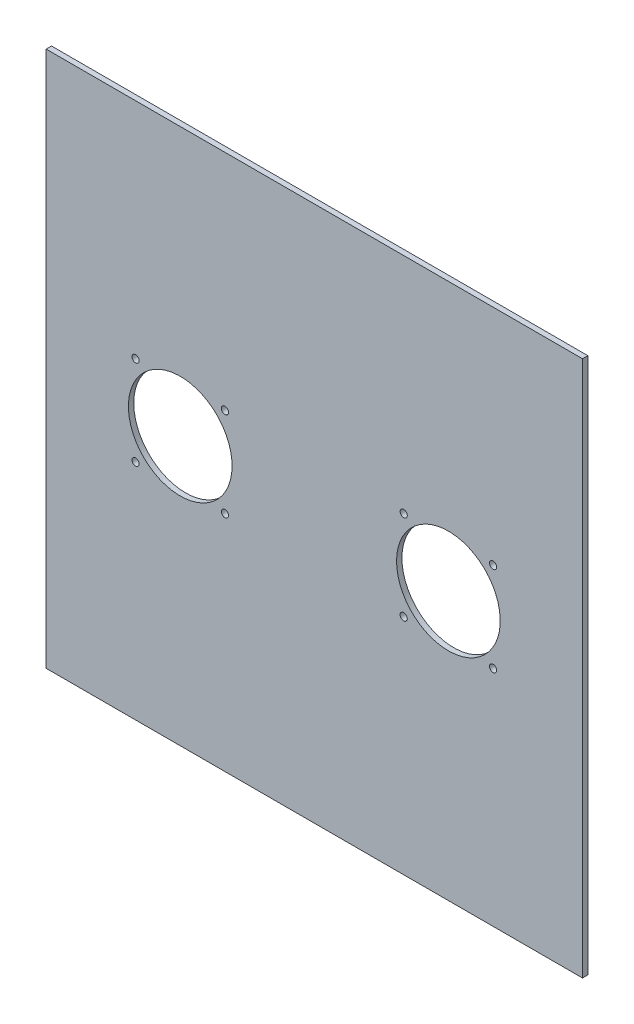
ISO-10303-21;
HEADER;
FILE_DESCRIPTION(('STEP AP214'),'2;1');
FILE_NAME('part.step','',(''),(''),'','','');
FILE_SCHEMA(('AUTOMOTIVE_DESIGN { 1 0 10303 214 1 1 1 1 }'));
ENDSEC;
DATA;
#1=APPLICATION_CONTEXT('core data for automotive mechanical design processes');
#2=APPLICATION_PROTOCOL_DEFINITION('international standard','automotive_design',2000,#1);
#3=PRODUCT_CONTEXT('',#1,'mechanical');
#4=PRODUCT('Part','Part','',(#3));
#5=PRODUCT_RELATED_PRODUCT_CATEGORY('part','',(#4));
#6=PRODUCT_DEFINITION_FORMATION('','',#4);
#7=PRODUCT_DEFINITION_CONTEXT('part definition',#1,'design');
#8=PRODUCT_DEFINITION('design','',#6,#7);
#9=PRODUCT_DEFINITION_SHAPE('','',#8);
#10=(LENGTH_UNIT() NAMED_UNIT(*) SI_UNIT(.MILLI.,.METRE.));
#11=(NAMED_UNIT(*) PLANE_ANGLE_UNIT() SI_UNIT($,.RADIAN.));
#12=(NAMED_UNIT(*) SI_UNIT($,.STERADIAN.) SOLID_ANGLE_UNIT());
#13=UNCERTAINTY_MEASURE_WITH_UNIT(LENGTH_MEASURE(1.E-05),#10,'distance_accuracy_value','');
#14=(GEOMETRIC_REPRESENTATION_CONTEXT(3) GLOBAL_UNCERTAINTY_ASSIGNED_CONTEXT((#13)) GLOBAL_UNIT_ASSIGNED_CONTEXT((#10,
#11,#12)) REPRESENTATION_CONTEXT('',''));
#15=CARTESIAN_POINT('',(0.,0.,0.));
#16=DIRECTION('',(0.,0.,1.));
#17=DIRECTION('',(1.,0.,0.));
#18=AXIS2_PLACEMENT_3D('',#15,#16,#17);
#19=CARTESIAN_POINT('',(0.,0.,3.));
#20=DIRECTION('',(1.,0.,0.));
#21=DIRECTION('',(0.,0.,-1.));
#22=AXIS2_PLACEMENT_3D('',#19,#20,#21);
#23=PLANE('',#22);
#24=DIRECTION('',(0.,-1.,0.));
#25=VECTOR('',#24,1.);
#26=CARTESIAN_POINT('',(0.,0.,0.));
#27=LINE('',#26,#25);
#28=CARTESIAN_POINT('',(0.,300.,0.));
#29=VERTEX_POINT('',#28);
#30=CARTESIAN_POINT('',(0.,0.,0.));
#31=VERTEX_POINT('',#30);
#32=EDGE_CURVE('E100',#29,#31,#27,.T.);
#33=ORIENTED_EDGE('',*,*,#32,.T.);
#34=DIRECTION('',(0.,0.,-1.));
#35=VECTOR('',#34,1.);
#36=CARTESIAN_POINT('',(0.,0.,3.));
#37=LINE('',#36,#35);
#38=CARTESIAN_POINT('',(0.,0.,3.));
#39=VERTEX_POINT('',#38);
#40=EDGE_CURVE('E11',#39,#31,#37,.T.);
#41=ORIENTED_EDGE('',*,*,#40,.F.);
#42=DIRECTION('',(0.,-1.,0.));
#43=VECTOR('',#42,1.);
#44=CARTESIAN_POINT('',(0.,0.,3.));
#45=LINE('',#44,#43);
#46=CARTESIAN_POINT('',(0.,300.,3.));
#47=VERTEX_POINT('',#46);
#48=EDGE_CURVE('E87',#47,#39,#45,.T.);
#49=ORIENTED_EDGE('',*,*,#48,.F.);
#50=DIRECTION('',(0.,0.,-1.));
#51=VECTOR('',#50,1.);
#52=CARTESIAN_POINT('',(0.,300.,3.));
#53=LINE('',#52,#51);
#54=EDGE_CURVE('E96',#47,#29,#53,.T.);
#55=ORIENTED_EDGE('',*,*,#54,.T.);
#56=EDGE_LOOP('',(#33,#41,#49,#55));
#57=FACE_BOUND('',#56,.T.);
#58=ADVANCED_FACE('F34',(#57),#23,.F.);
#59=CARTESIAN_POINT('',(0.,0.,3.));
#60=DIRECTION('',(0.,1.,0.));
#61=DIRECTION('',(0.,0.,1.));
#62=AXIS2_PLACEMENT_3D('',#59,#60,#61);
#63=PLANE('',#62);
#64=DIRECTION('',(1.,0.,0.));
#65=VECTOR('',#64,1.);
#66=CARTESIAN_POINT('',(0.,0.,0.));
#67=LINE('',#66,#65);
#68=CARTESIAN_POINT('',(300.,0.,0.));
#69=VERTEX_POINT('',#68);
#70=EDGE_CURVE('E91',#31,#69,#67,.T.);
#71=ORIENTED_EDGE('',*,*,#70,.T.);
#72=DIRECTION('',(0.,0.,-1.));
#73=VECTOR('',#72,1.);
#74=CARTESIAN_POINT('',(300.,0.,3.));
#75=LINE('',#74,#73);
#76=CARTESIAN_POINT('',(300.,0.,3.));
#77=VERTEX_POINT('',#76);
#78=EDGE_CURVE('E43',#77,#69,#75,.T.);
#79=ORIENTED_EDGE('',*,*,#78,.F.);
#80=DIRECTION('',(1.,0.,0.));
#81=VECTOR('',#80,1.);
#82=CARTESIAN_POINT('',(0.,0.,3.));
#83=LINE('',#82,#81);
#84=EDGE_CURVE('E82',#39,#77,#83,.T.);
#85=ORIENTED_EDGE('',*,*,#84,.F.);
#86=ORIENTED_EDGE('',*,*,#40,.T.);
#87=EDGE_LOOP('',(#71,#79,#85,#86));
#88=FACE_BOUND('',#87,.T.);
#89=ADVANCED_FACE('F90',(#88),#63,.F.);
#90=CARTESIAN_POINT('',(300.,0.,3.));
#91=DIRECTION('',(-1.,0.,0.));
#92=DIRECTION('',(0.,0.,1.));
#93=AXIS2_PLACEMENT_3D('',#90,#91,#92);
#94=PLANE('',#93);
#95=DIRECTION('',(0.,1.,0.));
#96=VECTOR('',#95,1.);
#97=CARTESIAN_POINT('',(300.,0.,0.));
#98=LINE('',#97,#96);
#99=CARTESIAN_POINT('',(300.,300.,0.));
#100=VERTEX_POINT('',#99);
#101=EDGE_CURVE('E69',#69,#100,#98,.T.);
#102=ORIENTED_EDGE('',*,*,#101,.T.);
#103=DIRECTION('',(0.,0.,-1.));
#104=VECTOR('',#103,1.);
#105=CARTESIAN_POINT('',(300.,300.,3.));
#106=LINE('',#105,#104);
#107=CARTESIAN_POINT('',(300.,300.,3.));
#108=VERTEX_POINT('',#107);
#109=EDGE_CURVE('E92',#108,#100,#106,.T.);
#110=ORIENTED_EDGE('',*,*,#109,.F.);
#111=DIRECTION('',(0.,1.,0.));
#112=VECTOR('',#111,1.);
#113=CARTESIAN_POINT('',(300.,0.,3.));
#114=LINE('',#113,#112);
#115=EDGE_CURVE('E85',#77,#108,#114,.T.);
#116=ORIENTED_EDGE('',*,*,#115,.F.);
#117=ORIENTED_EDGE('',*,*,#78,.T.);
#118=EDGE_LOOP('',(#102,#110,#116,#117));
#119=FACE_BOUND('',#118,.T.);
#120=ADVANCED_FACE('F94',(#119),#94,.F.);
#121=CARTESIAN_POINT('',(0.,300.,3.));
#122=DIRECTION('',(0.,-1.,0.));
#123=DIRECTION('',(0.,0.,-1.));
#124=AXIS2_PLACEMENT_3D('',#121,#122,#123);
#125=PLANE('',#124);
#126=DIRECTION('',(-1.,0.,0.));
#127=VECTOR('',#126,1.);
#128=CARTESIAN_POINT('',(0.,300.,0.));
#129=LINE('',#128,#127);
#130=EDGE_CURVE('E75',#100,#29,#129,.T.);
#131=ORIENTED_EDGE('',*,*,#130,.T.);
#132=ORIENTED_EDGE('',*,*,#54,.F.);
#133=DIRECTION('',(-1.,0.,0.));
#134=VECTOR('',#133,1.);
#135=CARTESIAN_POINT('',(0.,300.,3.));
#136=LINE('',#135,#134);
#137=EDGE_CURVE('E52',#108,#47,#136,.T.);
#138=ORIENTED_EDGE('',*,*,#137,.F.);
#139=ORIENTED_EDGE('',*,*,#109,.T.);
#140=EDGE_LOOP('',(#131,#132,#138,#139));
#141=FACE_BOUND('',#140,.T.);
#142=ADVANCED_FACE('F166',(#141),#125,.F.);
#143=CARTESIAN_POINT('',(0.,0.,3.));
#144=DIRECTION('',(0.,0.,-1.));
#145=DIRECTION('',(-1.,0.,0.));
#146=AXIS2_PLACEMENT_3D('',#143,#144,#145);
#147=PLANE('',#146);
#148=CARTESIAN_POINT('',(75.,150.,3.));
#149=DIRECTION('',(0.,0.,1.));
#150=DIRECTION('',(1.,0.,0.));
#151=AXIS2_PLACEMENT_3D('',#148,#149,#150);
#152=CIRCLE('',#151,29.);
#153=CARTESIAN_POINT('',(104.,150.,3.));
#154=VERTEX_POINT('',#153);
#155=EDGE_CURVE('E303',#154,#154,#152,.T.);
#156=ORIENTED_EDGE('',*,*,#155,.F.);
#157=EDGE_LOOP('',(#156));
#158=FACE_BOUND('',#157,.T.);
#159=CARTESIAN_POINT('',(250.,125.,3.));
#160=DIRECTION('',(0.,0.,1.));
#161=DIRECTION('',(1.,0.,0.));
#162=AXIS2_PLACEMENT_3D('',#159,#160,#161);
#163=CIRCLE('',#162,2.00000000000005);
#164=CARTESIAN_POINT('',(252.,125.,3.));
#165=VERTEX_POINT('',#164);
#166=EDGE_CURVE('E301',#165,#165,#163,.T.);
#167=ORIENTED_EDGE('',*,*,#166,.F.);
#168=EDGE_LOOP('',(#167));
#169=FACE_BOUND('',#168,.T.);
#170=CARTESIAN_POINT('',(225.,150.,3.));
#171=DIRECTION('',(0.,0.,1.));
#172=DIRECTION('',(-1.,0.,0.));
#173=AXIS2_PLACEMENT_3D('',#170,#171,#172);
#174=CIRCLE('',#173,29.);
#175=CARTESIAN_POINT('',(196.,150.,3.));
#176=VERTEX_POINT('',#175);
#177=EDGE_CURVE('E310',#176,#176,#174,.T.);
#178=ORIENTED_EDGE('',*,*,#177,.F.);
#179=EDGE_LOOP('',(#178));
#180=FACE_BOUND('',#179,.T.);
#181=CARTESIAN_POINT('',(200.,175.,3.));
#182=DIRECTION('',(0.,0.,1.));
#183=DIRECTION('',(1.,0.,0.));
#184=AXIS2_PLACEMENT_3D('',#181,#182,#183);
#185=CIRCLE('',#184,2.);
#186=CARTESIAN_POINT('',(202.,175.,3.));
#187=VERTEX_POINT('',#186);
#188=EDGE_CURVE('E304',#187,#187,#185,.T.);
#189=ORIENTED_EDGE('',*,*,#188,.F.);
#190=EDGE_LOOP('',(#189));
#191=FACE_BOUND('',#190,.T.);
#192=CARTESIAN_POINT('',(50.,125.,3.));
#193=DIRECTION('',(0.,0.,1.));
#194=DIRECTION('',(-1.,0.,0.));
#195=AXIS2_PLACEMENT_3D('',#192,#193,#194);
#196=CIRCLE('',#195,2.);
#197=CARTESIAN_POINT('',(48.,125.,3.));
#198=VERTEX_POINT('',#197);
#199=EDGE_CURVE('E307',#198,#198,#196,.T.);
#200=ORIENTED_EDGE('',*,*,#199,.F.);
#201=EDGE_LOOP('',(#200));
#202=FACE_BOUND('',#201,.T.);
#203=CARTESIAN_POINT('',(100.,125.,3.));
#204=DIRECTION('',(0.,0.,1.));
#205=DIRECTION('',(1.,0.,0.));
#206=AXIS2_PLACEMENT_3D('',#203,#204,#205);
#207=CIRCLE('',#206,2.);
#208=CARTESIAN_POINT('',(102.,125.,3.));
#209=VERTEX_POINT('',#208);
#210=EDGE_CURVE('E319',#209,#209,#207,.T.);
#211=ORIENTED_EDGE('',*,*,#210,.F.);
#212=EDGE_LOOP('',(#211));
#213=FACE_BOUND('',#212,.T.);
#214=CARTESIAN_POINT('',(100.,175.,3.));
#215=DIRECTION('',(0.,0.,1.));
#216=DIRECTION('',(-1.,0.,0.));
#217=AXIS2_PLACEMENT_3D('',#214,#215,#216);
#218=CIRCLE('',#217,2.);
#219=CARTESIAN_POINT('',(98.,175.,3.));
#220=VERTEX_POINT('',#219);
#221=EDGE_CURVE('E316',#220,#220,#218,.T.);
#222=ORIENTED_EDGE('',*,*,#221,.F.);
#223=EDGE_LOOP('',(#222));
#224=FACE_BOUND('',#223,.T.);
#225=CARTESIAN_POINT('',(50.,175.,3.));
#226=DIRECTION('',(0.,0.,1.));
#227=DIRECTION('',(1.,0.,0.));
#228=AXIS2_PLACEMENT_3D('',#225,#226,#227);
#229=CIRCLE('',#228,2.);
#230=CARTESIAN_POINT('',(52.,175.,3.));
#231=VERTEX_POINT('',#230);
#232=EDGE_CURVE('E313',#231,#231,#229,.T.);
#233=ORIENTED_EDGE('',*,*,#232,.F.);
#234=EDGE_LOOP('',(#233));
#235=FACE_BOUND('',#234,.T.);
#236=CARTESIAN_POINT('',(250.,175.,3.));
#237=DIRECTION('',(0.,0.,1.));
#238=DIRECTION('',(-1.,0.,0.));
#239=AXIS2_PLACEMENT_3D('',#236,#237,#238);
#240=CIRCLE('',#239,2.00000000000005);
#241=CARTESIAN_POINT('',(248.,175.,3.));
#242=VERTEX_POINT('',#241);
#243=EDGE_CURVE('E340',#242,#242,#240,.T.);
#244=ORIENTED_EDGE('',*,*,#243,.F.);
#245=EDGE_LOOP('',(#244));
#246=FACE_BOUND('',#245,.T.);
#247=CARTESIAN_POINT('',(200.,125.,3.));
#248=DIRECTION('',(0.,0.,1.));
#249=DIRECTION('',(-1.,0.,0.));
#250=AXIS2_PLACEMENT_3D('',#247,#248,#249);
#251=CIRCLE('',#250,2.);
#252=CARTESIAN_POINT('',(198.,125.,3.));
#253=VERTEX_POINT('',#252);
#254=EDGE_CURVE('E112',#253,#253,#251,.T.);
#255=ORIENTED_EDGE('',*,*,#254,.F.);
#256=EDGE_LOOP('',(#255));
#257=FACE_BOUND('',#256,.T.);
#258=ORIENTED_EDGE('',*,*,#48,.T.);
#259=ORIENTED_EDGE('',*,*,#84,.T.);
#260=ORIENTED_EDGE('',*,*,#115,.T.);
#261=ORIENTED_EDGE('',*,*,#137,.T.);
#262=EDGE_LOOP('',(#258,#259,#260,#261));
#263=FACE_BOUND('',#262,.T.);
#264=ADVANCED_FACE('F83',(#158,#169,#180,#191,#202,#213,#224,#235,#246,#257,#263),#147,.F.);
#265=CARTESIAN_POINT('',(0.,0.,0.));
#266=DIRECTION('',(0.,0.,-1.));
#267=DIRECTION('',(-1.,0.,0.));
#268=AXIS2_PLACEMENT_3D('',#265,#266,#267);
#269=PLANE('',#268);
#270=CARTESIAN_POINT('',(75.,150.,0.));
#271=DIRECTION('',(0.,0.,-1.));
#272=DIRECTION('',(-1.,0.,0.));
#273=AXIS2_PLACEMENT_3D('',#270,#271,#272);
#274=CIRCLE('',#273,29.);
#275=CARTESIAN_POINT('',(46.,150.,0.));
#276=VERTEX_POINT('',#275);
#277=EDGE_CURVE('E37',#276,#276,#274,.T.);
#278=ORIENTED_EDGE('',*,*,#277,.F.);
#279=EDGE_LOOP('',(#278));
#280=FACE_BOUND('',#279,.T.);
#281=CARTESIAN_POINT('',(250.,125.,0.));
#282=DIRECTION('',(0.,0.,-1.));
#283=DIRECTION('',(-1.,0.,0.));
#284=AXIS2_PLACEMENT_3D('',#281,#282,#283);
#285=CIRCLE('',#284,2.00000000000005);
#286=CARTESIAN_POINT('',(248.,125.,0.));
#287=VERTEX_POINT('',#286);
#288=EDGE_CURVE('E132',#287,#287,#285,.T.);
#289=ORIENTED_EDGE('',*,*,#288,.F.);
#290=EDGE_LOOP('',(#289));
#291=FACE_BOUND('',#290,.T.);
#292=CARTESIAN_POINT('',(225.,150.,0.));
#293=DIRECTION('',(0.,0.,-1.));
#294=DIRECTION('',(-1.,0.,0.));
#295=AXIS2_PLACEMENT_3D('',#292,#293,#294);
#296=CIRCLE('',#295,29.);
#297=CARTESIAN_POINT('',(196.,150.,0.));
#298=VERTEX_POINT('',#297);
#299=EDGE_CURVE('E130',#298,#298,#296,.T.);
#300=ORIENTED_EDGE('',*,*,#299,.F.);
#301=EDGE_LOOP('',(#300));
#302=FACE_BOUND('',#301,.T.);
#303=CARTESIAN_POINT('',(200.,175.,0.));
#304=DIRECTION('',(0.,0.,-1.));
#305=DIRECTION('',(-1.,0.,0.));
#306=AXIS2_PLACEMENT_3D('',#303,#304,#305);
#307=CIRCLE('',#306,2.);
#308=CARTESIAN_POINT('',(198.,175.,0.));
#309=VERTEX_POINT('',#308);
#310=EDGE_CURVE('E127',#309,#309,#307,.T.);
#311=ORIENTED_EDGE('',*,*,#310,.F.);
#312=EDGE_LOOP('',(#311));
#313=FACE_BOUND('',#312,.T.);
#314=CARTESIAN_POINT('',(50.,125.,0.));
#315=DIRECTION('',(0.,0.,-1.));
#316=DIRECTION('',(-1.,0.,0.));
#317=AXIS2_PLACEMENT_3D('',#314,#315,#316);
#318=CIRCLE('',#317,2.);
#319=CARTESIAN_POINT('',(48.,125.,0.));
#320=VERTEX_POINT('',#319);
#321=EDGE_CURVE('E124',#320,#320,#318,.T.);
#322=ORIENTED_EDGE('',*,*,#321,.F.);
#323=EDGE_LOOP('',(#322));
#324=FACE_BOUND('',#323,.T.);
#325=CARTESIAN_POINT('',(100.,125.,0.));
#326=DIRECTION('',(0.,0.,-1.));
#327=DIRECTION('',(-1.,0.,0.));
#328=AXIS2_PLACEMENT_3D('',#325,#326,#327);
#329=CIRCLE('',#328,2.);
#330=CARTESIAN_POINT('',(98.,125.,0.));
#331=VERTEX_POINT('',#330);
#332=EDGE_CURVE('E121',#331,#331,#329,.T.);
#333=ORIENTED_EDGE('',*,*,#332,.F.);
#334=EDGE_LOOP('',(#333));
#335=FACE_BOUND('',#334,.T.);
#336=CARTESIAN_POINT('',(100.,175.,0.));
#337=DIRECTION('',(0.,0.,-1.));
#338=DIRECTION('',(-1.,0.,0.));
#339=AXIS2_PLACEMENT_3D('',#336,#337,#338);
#340=CIRCLE('',#339,2.);
#341=CARTESIAN_POINT('',(98.,175.,0.));
#342=VERTEX_POINT('',#341);
#343=EDGE_CURVE('E118',#342,#342,#340,.T.);
#344=ORIENTED_EDGE('',*,*,#343,.F.);
#345=EDGE_LOOP('',(#344));
#346=FACE_BOUND('',#345,.T.);
#347=CARTESIAN_POINT('',(50.,175.,0.));
#348=DIRECTION('',(0.,0.,-1.));
#349=DIRECTION('',(-1.,0.,0.));
#350=AXIS2_PLACEMENT_3D('',#347,#348,#349);
#351=CIRCLE('',#350,2.);
#352=CARTESIAN_POINT('',(48.,175.,0.));
#353=VERTEX_POINT('',#352);
#354=EDGE_CURVE('E115',#353,#353,#351,.T.);
#355=ORIENTED_EDGE('',*,*,#354,.F.);
#356=EDGE_LOOP('',(#355));
#357=FACE_BOUND('',#356,.T.);
#358=CARTESIAN_POINT('',(250.,175.,0.));
#359=DIRECTION('',(0.,0.,-1.));
#360=DIRECTION('',(-1.,0.,0.));
#361=AXIS2_PLACEMENT_3D('',#358,#359,#360);
#362=CIRCLE('',#361,2.00000000000005);
#363=CARTESIAN_POINT('',(248.,175.,0.));
#364=VERTEX_POINT('',#363);
#365=EDGE_CURVE('E111',#364,#364,#362,.T.);
#366=ORIENTED_EDGE('',*,*,#365,.F.);
#367=EDGE_LOOP('',(#366));
#368=FACE_BOUND('',#367,.T.);
#369=CARTESIAN_POINT('',(200.,125.,0.));
#370=DIRECTION('',(0.,0.,-1.));
#371=DIRECTION('',(-1.,0.,0.));
#372=AXIS2_PLACEMENT_3D('',#369,#370,#371);
#373=CIRCLE('',#372,2.);
#374=CARTESIAN_POINT('',(198.,125.,0.));
#375=VERTEX_POINT('',#374);
#376=EDGE_CURVE('E108',#375,#375,#373,.T.);
#377=ORIENTED_EDGE('',*,*,#376,.F.);
#378=EDGE_LOOP('',(#377));
#379=FACE_BOUND('',#378,.T.);
#380=ORIENTED_EDGE('',*,*,#32,.F.);
#381=ORIENTED_EDGE('',*,*,#130,.F.);
#382=ORIENTED_EDGE('',*,*,#101,.F.);
#383=ORIENTED_EDGE('',*,*,#70,.F.);
#384=EDGE_LOOP('',(#380,#381,#382,#383));
#385=FACE_BOUND('',#384,.T.);
#386=ADVANCED_FACE('F142',(#280,#291,#302,#313,#324,#335,#346,#357,#368,#379,#385),#269,.T.);
#387=CARTESIAN_POINT('',(200.,125.,-7.));
#388=DIRECTION('',(0.,0.,1.));
#389=DIRECTION('',(1.,0.,0.));
#390=AXIS2_PLACEMENT_3D('',#387,#388,#389);
#391=CYLINDRICAL_SURFACE('',#390,2.);
#392=ORIENTED_EDGE('',*,*,#376,.T.);
#393=EDGE_LOOP('',(#392));
#394=FACE_BOUND('',#393,.T.);
#395=ORIENTED_EDGE('',*,*,#254,.T.);
#396=EDGE_LOOP('',(#395));
#397=FACE_BOUND('',#396,.T.);
#398=ADVANCED_FACE('F145',(#394,#397),#391,.F.);
#399=CARTESIAN_POINT('',(250.,175.,-7.));
#400=DIRECTION('',(0.,0.,1.));
#401=DIRECTION('',(1.,0.,0.));
#402=AXIS2_PLACEMENT_3D('',#399,#400,#401);
#403=CYLINDRICAL_SURFACE('',#402,2.00000000000005);
#404=ORIENTED_EDGE('',*,*,#365,.T.);
#405=EDGE_LOOP('',(#404));
#406=FACE_BOUND('',#405,.T.);
#407=ORIENTED_EDGE('',*,*,#243,.T.);
#408=EDGE_LOOP('',(#407));
#409=FACE_BOUND('',#408,.T.);
#410=ADVANCED_FACE('F207',(#406,#409),#403,.F.);
#411=CARTESIAN_POINT('',(50.,175.,-7.));
#412=DIRECTION('',(0.,0.,1.));
#413=DIRECTION('',(1.,0.,0.));
#414=AXIS2_PLACEMENT_3D('',#411,#412,#413);
#415=CYLINDRICAL_SURFACE('',#414,2.);
#416=ORIENTED_EDGE('',*,*,#354,.T.);
#417=EDGE_LOOP('',(#416));
#418=FACE_BOUND('',#417,.T.);
#419=ORIENTED_EDGE('',*,*,#232,.T.);
#420=EDGE_LOOP('',(#419));
#421=FACE_BOUND('',#420,.T.);
#422=ADVANCED_FACE('F217',(#418,#421),#415,.F.);
#423=CARTESIAN_POINT('',(100.,175.,-7.));
#424=DIRECTION('',(0.,0.,1.));
#425=DIRECTION('',(1.,0.,0.));
#426=AXIS2_PLACEMENT_3D('',#423,#424,#425);
#427=CYLINDRICAL_SURFACE('',#426,2.);
#428=ORIENTED_EDGE('',*,*,#343,.T.);
#429=EDGE_LOOP('',(#428));
#430=FACE_BOUND('',#429,.T.);
#431=ORIENTED_EDGE('',*,*,#221,.T.);
#432=EDGE_LOOP('',(#431));
#433=FACE_BOUND('',#432,.T.);
#434=ADVANCED_FACE('F227',(#430,#433),#427,.F.);
#435=CARTESIAN_POINT('',(100.,125.,-7.));
#436=DIRECTION('',(0.,0.,1.));
#437=DIRECTION('',(1.,0.,0.));
#438=AXIS2_PLACEMENT_3D('',#435,#436,#437);
#439=CYLINDRICAL_SURFACE('',#438,2.);
#440=ORIENTED_EDGE('',*,*,#332,.T.);
#441=EDGE_LOOP('',(#440));
#442=FACE_BOUND('',#441,.T.);
#443=ORIENTED_EDGE('',*,*,#210,.T.);
#444=EDGE_LOOP('',(#443));
#445=FACE_BOUND('',#444,.T.);
#446=ADVANCED_FACE('F237',(#442,#445),#439,.F.);
#447=CARTESIAN_POINT('',(50.,125.,-7.));
#448=DIRECTION('',(0.,0.,1.));
#449=DIRECTION('',(1.,0.,0.));
#450=AXIS2_PLACEMENT_3D('',#447,#448,#449);
#451=CYLINDRICAL_SURFACE('',#450,2.);
#452=ORIENTED_EDGE('',*,*,#321,.T.);
#453=EDGE_LOOP('',(#452));
#454=FACE_BOUND('',#453,.T.);
#455=ORIENTED_EDGE('',*,*,#199,.T.);
#456=EDGE_LOOP('',(#455));
#457=FACE_BOUND('',#456,.T.);
#458=ADVANCED_FACE('F247',(#454,#457),#451,.F.);
#459=CARTESIAN_POINT('',(200.,175.,-7.));
#460=DIRECTION('',(0.,0.,1.));
#461=DIRECTION('',(1.,0.,0.));
#462=AXIS2_PLACEMENT_3D('',#459,#460,#461);
#463=CYLINDRICAL_SURFACE('',#462,2.);
#464=ORIENTED_EDGE('',*,*,#310,.T.);
#465=EDGE_LOOP('',(#464));
#466=FACE_BOUND('',#465,.T.);
#467=ORIENTED_EDGE('',*,*,#188,.T.);
#468=EDGE_LOOP('',(#467));
#469=FACE_BOUND('',#468,.T.);
#470=ADVANCED_FACE('F257',(#466,#469),#463,.F.);
#471=CARTESIAN_POINT('',(225.,150.,-7.));
#472=DIRECTION('',(0.,0.,1.));
#473=DIRECTION('',(1.,0.,0.));
#474=AXIS2_PLACEMENT_3D('',#471,#472,#473);
#475=CYLINDRICAL_SURFACE('',#474,29.);
#476=ORIENTED_EDGE('',*,*,#299,.T.);
#477=EDGE_LOOP('',(#476));
#478=FACE_BOUND('',#477,.T.);
#479=ORIENTED_EDGE('',*,*,#177,.T.);
#480=EDGE_LOOP('',(#479));
#481=FACE_BOUND('',#480,.T.);
#482=ADVANCED_FACE('F267',(#478,#481),#475,.F.);
#483=CARTESIAN_POINT('',(250.,125.,-7.));
#484=DIRECTION('',(0.,0.,1.));
#485=DIRECTION('',(1.,0.,0.));
#486=AXIS2_PLACEMENT_3D('',#483,#484,#485);
#487=CYLINDRICAL_SURFACE('',#486,2.00000000000005);
#488=ORIENTED_EDGE('',*,*,#288,.T.);
#489=EDGE_LOOP('',(#488));
#490=FACE_BOUND('',#489,.T.);
#491=ORIENTED_EDGE('',*,*,#166,.T.);
#492=EDGE_LOOP('',(#491));
#493=FACE_BOUND('',#492,.T.);
#494=ADVANCED_FACE('F277',(#490,#493),#487,.F.);
#495=CARTESIAN_POINT('',(75.,150.,-7.));
#496=DIRECTION('',(0.,0.,1.));
#497=DIRECTION('',(1.,0.,0.));
#498=AXIS2_PLACEMENT_3D('',#495,#496,#497);
#499=CYLINDRICAL_SURFACE('',#498,29.);
#500=ORIENTED_EDGE('',*,*,#277,.T.);
#501=EDGE_LOOP('',(#500));
#502=FACE_BOUND('',#501,.T.);
#503=ORIENTED_EDGE('',*,*,#155,.T.);
#504=EDGE_LOOP('',(#503));
#505=FACE_BOUND('',#504,.T.);
#506=ADVANCED_FACE('F139',(#502,#505),#499,.F.);
#507=CLOSED_SHELL('',(#58,#89,#120,#142,#264,#386,#398,#410,#422,#434,#446,#458,#470,#482,#494,#506));
#508=MANIFOLD_SOLID_BREP('B2',#507);
#509=ADVANCED_BREP_SHAPE_REPRESENTATION('',(#18,#508),#14);
#510=SHAPE_DEFINITION_REPRESENTATION(#9,#509);
ENDSEC;
END-ISO-10303-21;
